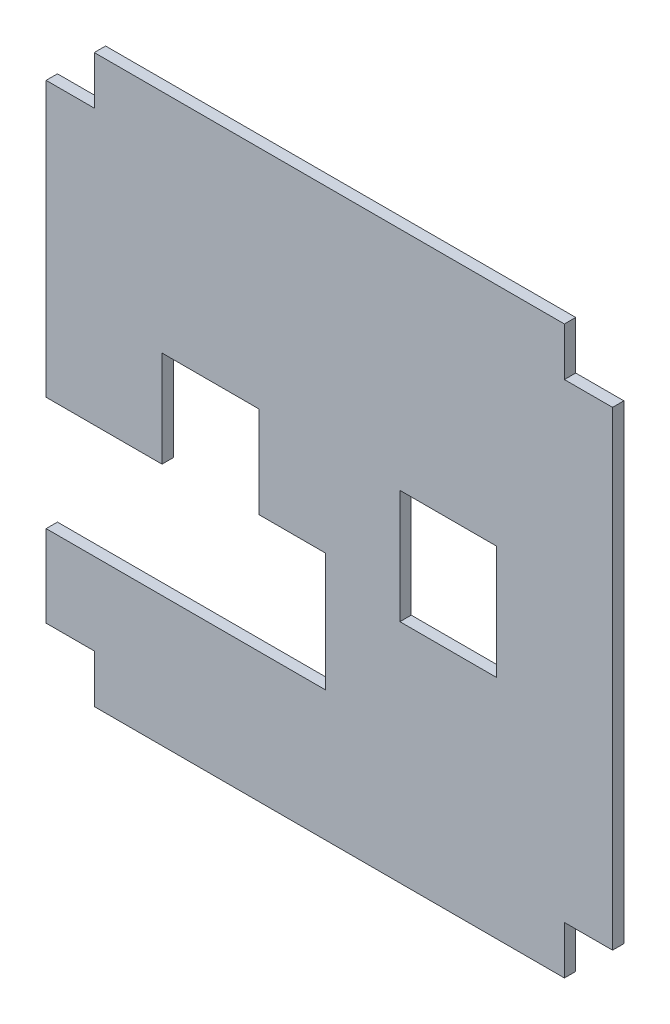
ISO-10303-21;
HEADER;
FILE_DESCRIPTION(('STEP AP214'),'2;1');
FILE_NAME('part.step','',(''),(''),'','','');
FILE_SCHEMA(('AUTOMOTIVE_DESIGN { 1 0 10303 214 1 1 1 1 }'));
ENDSEC;
DATA;
#1=APPLICATION_CONTEXT('core data for automotive mechanical design processes');
#2=APPLICATION_PROTOCOL_DEFINITION('international standard','automotive_design',2000,#1);
#3=PRODUCT_CONTEXT('',#1,'mechanical');
#4=PRODUCT('Part','Part','',(#3));
#5=PRODUCT_RELATED_PRODUCT_CATEGORY('part','',(#4));
#6=PRODUCT_DEFINITION_FORMATION('','',#4);
#7=PRODUCT_DEFINITION_CONTEXT('part definition',#1,'design');
#8=PRODUCT_DEFINITION('design','',#6,#7);
#9=PRODUCT_DEFINITION_SHAPE('','',#8);
#10=(LENGTH_UNIT() NAMED_UNIT(*) SI_UNIT(.MILLI.,.METRE.));
#11=(NAMED_UNIT(*) PLANE_ANGLE_UNIT() SI_UNIT($,.RADIAN.));
#12=(NAMED_UNIT(*) SI_UNIT($,.STERADIAN.) SOLID_ANGLE_UNIT());
#13=UNCERTAINTY_MEASURE_WITH_UNIT(LENGTH_MEASURE(1.E-05),#10,'distance_accuracy_value','');
#14=(GEOMETRIC_REPRESENTATION_CONTEXT(3) GLOBAL_UNCERTAINTY_ASSIGNED_CONTEXT((#13)) GLOBAL_UNIT_ASSIGNED_CONTEXT((#10,
#11,#12)) REPRESENTATION_CONTEXT('',''));
#15=CARTESIAN_POINT('',(0.,0.,0.));
#16=DIRECTION('',(0.,0.,1.));
#17=DIRECTION('',(1.,0.,0.));
#18=AXIS2_PLACEMENT_3D('',#15,#16,#17);
#19=CARTESIAN_POINT('',(0.,0.,2.));
#20=DIRECTION('',(0.,0.,1.));
#21=DIRECTION('',(1.,0.,0.));
#22=AXIS2_PLACEMENT_3D('',#19,#20,#21);
#23=PLANE('',#22);
#24=DIRECTION('',(0.,1.,0.));
#25=VECTOR('',#24,1.);
#26=CARTESIAN_POINT('',(-66.7256915186091,-230.23629040322,2.));
#27=LINE('',#26,#25);
#28=CARTESIAN_POINT('',(-66.7256915186091,-230.23629040322,2.));
#29=VERTEX_POINT('',#28);
#30=CARTESIAN_POINT('',(-66.7256915186091,-221.73629040322,2.));
#31=VERTEX_POINT('',#30);
#32=EDGE_CURVE('E232',#29,#31,#27,.T.);
#33=ORIENTED_EDGE('',*,*,#32,.T.);
#34=DIRECTION('',(-1.,0.,0.));
#35=VECTOR('',#34,1.);
#36=CARTESIAN_POINT('',(-66.7256915186091,-221.73629040322,2.));
#37=LINE('',#36,#35);
#38=CARTESIAN_POINT('',(-149.725691518609,-221.73629040322,2.));
#39=VERTEX_POINT('',#38);
#40=EDGE_CURVE('E235',#31,#39,#37,.T.);
#41=ORIENTED_EDGE('',*,*,#40,.T.);
#42=DIRECTION('',(0.,-1.,0.));
#43=VECTOR('',#42,1.);
#44=CARTESIAN_POINT('',(-149.725691518609,-221.73629040322,2.));
#45=LINE('',#44,#43);
#46=CARTESIAN_POINT('',(-149.725691518609,-230.23629040322,2.));
#47=VERTEX_POINT('',#46);
#48=EDGE_CURVE('E238',#39,#47,#45,.T.);
#49=ORIENTED_EDGE('',*,*,#48,.T.);
#50=DIRECTION('',(-1.,0.,0.));
#51=VECTOR('',#50,1.);
#52=CARTESIAN_POINT('',(-149.725691518609,-230.23629040322,2.));
#53=LINE('',#52,#51);
#54=CARTESIAN_POINT('',(-158.225691518609,-230.23629040322,2.));
#55=VERTEX_POINT('',#54);
#56=EDGE_CURVE('E240',#47,#55,#53,.T.);
#57=ORIENTED_EDGE('',*,*,#56,.T.);
#58=DIRECTION('',(0.,-1.,0.));
#59=VECTOR('',#58,1.);
#60=CARTESIAN_POINT('',(-158.225691518609,-230.23629040322,2.));
#61=LINE('',#60,#59);
#62=CARTESIAN_POINT('',(-158.225691518609,-278.696286353221,2.));
#63=VERTEX_POINT('',#62);
#64=EDGE_CURVE('E242',#55,#63,#61,.T.);
#65=ORIENTED_EDGE('',*,*,#64,.T.);
#66=DIRECTION('',(1.,0.,0.));
#67=VECTOR('',#66,1.);
#68=CARTESIAN_POINT('',(-158.225691518609,-278.696286353221,2.));
#69=LINE('',#68,#67);
#70=CARTESIAN_POINT('',(-137.765694758609,-278.696286353221,2.));
#71=VERTEX_POINT('',#70);
#72=EDGE_CURVE('E244',#63,#71,#69,.T.);
#73=ORIENTED_EDGE('',*,*,#72,.T.);
#74=DIRECTION('',(0.,1.,0.));
#75=VECTOR('',#74,1.);
#76=CARTESIAN_POINT('',(-137.765694758609,-261.696286353221,2.));
#77=LINE('',#76,#75);
#78=CARTESIAN_POINT('',(-137.765694758609,-261.696286353221,2.));
#79=VERTEX_POINT('',#78);
#80=EDGE_CURVE('E246',#71,#79,#77,.T.);
#81=ORIENTED_EDGE('',*,*,#80,.T.);
#82=DIRECTION('',(1.,0.,0.));
#83=VECTOR('',#82,1.);
#84=CARTESIAN_POINT('',(-120.685688280496,-261.696286353221,2.));
#85=LINE('',#84,#83);
#86=CARTESIAN_POINT('',(-120.685688280496,-261.696286353221,2.));
#87=VERTEX_POINT('',#86);
#88=EDGE_CURVE('E248',#79,#87,#85,.T.);
#89=ORIENTED_EDGE('',*,*,#88,.T.);
#90=DIRECTION('',(0.,-1.,0.));
#91=VECTOR('',#90,1.);
#92=CARTESIAN_POINT('',(-120.685688280496,-277.856055269979,2.));
#93=LINE('',#92,#91);
#94=CARTESIAN_POINT('',(-120.685688280496,-277.856055269979,2.));
#95=VERTEX_POINT('',#94);
#96=EDGE_CURVE('E250',#87,#95,#93,.T.);
#97=ORIENTED_EDGE('',*,*,#96,.T.);
#98=DIRECTION('',(1.,0.,0.));
#99=VECTOR('',#98,1.);
#100=CARTESIAN_POINT('',(-120.685688280496,-277.856055269979,2.));
#101=LINE('',#100,#99);
#102=CARTESIAN_POINT('',(-108.863916488469,-277.856055269979,2.));
#103=VERTEX_POINT('',#102);
#104=EDGE_CURVE('E252',#95,#103,#101,.T.);
#105=ORIENTED_EDGE('',*,*,#104,.T.);
#106=DIRECTION('',(0.,-1.,0.));
#107=VECTOR('',#106,1.);
#108=CARTESIAN_POINT('',(-108.863916488469,-277.856055269979,2.));
#109=LINE('',#108,#107);
#110=CARTESIAN_POINT('',(-108.863916488469,-298.77629445322,2.));
#111=VERTEX_POINT('',#110);
#112=EDGE_CURVE('E254',#103,#111,#109,.T.);
#113=ORIENTED_EDGE('',*,*,#112,.T.);
#114=DIRECTION('',(-1.,0.,0.));
#115=VECTOR('',#114,1.);
#116=CARTESIAN_POINT('',(-122.185689088609,-298.77629445322,2.));
#117=LINE('',#116,#115);
#118=CARTESIAN_POINT('',(-158.225691518609,-298.77629445322,2.));
#119=VERTEX_POINT('',#118);
#120=EDGE_CURVE('E256',#111,#119,#117,.T.);
#121=ORIENTED_EDGE('',*,*,#120,.T.);
#122=DIRECTION('',(0.,-1.,0.));
#123=VECTOR('',#122,1.);
#124=CARTESIAN_POINT('',(-158.225691518609,-298.77629445322,2.));
#125=LINE('',#124,#123);
#126=CARTESIAN_POINT('',(-158.225691518609,-313.23629040322,2.));
#127=VERTEX_POINT('',#126);
#128=EDGE_CURVE('E258',#119,#127,#125,.T.);
#129=ORIENTED_EDGE('',*,*,#128,.T.);
#130=DIRECTION('',(1.,0.,0.));
#131=VECTOR('',#130,1.);
#132=CARTESIAN_POINT('',(-158.225691518609,-313.23629040322,2.));
#133=LINE('',#132,#131);
#134=CARTESIAN_POINT('',(-149.725691518609,-313.23629040322,2.));
#135=VERTEX_POINT('',#134);
#136=EDGE_CURVE('E260',#127,#135,#133,.T.);
#137=ORIENTED_EDGE('',*,*,#136,.T.);
#138=DIRECTION('',(0.,-1.,0.));
#139=VECTOR('',#138,1.);
#140=CARTESIAN_POINT('',(-149.725691518609,-313.23629040322,2.));
#141=LINE('',#140,#139);
#142=CARTESIAN_POINT('',(-149.725691518609,-321.73629040322,2.));
#143=VERTEX_POINT('',#142);
#144=EDGE_CURVE('E262',#135,#143,#141,.T.);
#145=ORIENTED_EDGE('',*,*,#144,.T.);
#146=DIRECTION('',(1.,0.,0.));
#147=VECTOR('',#146,1.);
#148=CARTESIAN_POINT('',(-149.725691518609,-321.73629040322,2.));
#149=LINE('',#148,#147);
#150=CARTESIAN_POINT('',(-66.7256915186091,-321.73629040322,2.));
#151=VERTEX_POINT('',#150);
#152=EDGE_CURVE('E264',#143,#151,#149,.T.);
#153=ORIENTED_EDGE('',*,*,#152,.T.);
#154=DIRECTION('',(0.,1.,0.));
#155=VECTOR('',#154,1.);
#156=CARTESIAN_POINT('',(-66.7256915186091,-321.73629040322,2.));
#157=LINE('',#156,#155);
#158=CARTESIAN_POINT('',(-66.7256915186091,-313.23629040322,2.));
#159=VERTEX_POINT('',#158);
#160=EDGE_CURVE('E266',#151,#159,#157,.T.);
#161=ORIENTED_EDGE('',*,*,#160,.T.);
#162=DIRECTION('',(1.,0.,0.));
#163=VECTOR('',#162,1.);
#164=CARTESIAN_POINT('',(-66.7256915186091,-313.23629040322,2.));
#165=LINE('',#164,#163);
#166=CARTESIAN_POINT('',(-58.2256915186091,-313.23629040322,2.));
#167=VERTEX_POINT('',#166);
#168=EDGE_CURVE('E268',#159,#167,#165,.T.);
#169=ORIENTED_EDGE('',*,*,#168,.T.);
#170=DIRECTION('',(0.,1.,0.));
#171=VECTOR('',#170,1.);
#172=CARTESIAN_POINT('',(-58.2256915186091,-313.23629040322,2.));
#173=LINE('',#172,#171);
#174=CARTESIAN_POINT('',(-58.2256915186091,-230.23629040322,2.));
#175=VERTEX_POINT('',#174);
#176=EDGE_CURVE('E270',#167,#175,#173,.T.);
#177=ORIENTED_EDGE('',*,*,#176,.T.);
#178=DIRECTION('',(-1.,0.,0.));
#179=VECTOR('',#178,1.);
#180=CARTESIAN_POINT('',(-58.2256915186091,-230.23629040322,2.));
#181=LINE('',#180,#179);
#182=EDGE_CURVE('E272',#175,#29,#181,.T.);
#183=ORIENTED_EDGE('',*,*,#182,.T.);
#184=EDGE_LOOP('',(#33,#41,#49,#57,#65,#73,#81,#89,#97,#105,#113,#121,#129,#137,#145,#153,#161,
#169,#177,#183));
#185=FACE_BOUND('',#184,.T.);
#186=DIRECTION('',(0.,-1.,0.));
#187=VECTOR('',#186,1.);
#188=CARTESIAN_POINT('',(-95.7656947578864,-261.696286353221,2.));
#189=LINE('',#188,#187);
#190=CARTESIAN_POINT('',(-95.7656947578864,-261.696286353221,2.));
#191=VERTEX_POINT('',#190);
#192=CARTESIAN_POINT('',(-95.7656947578864,-281.77629445322,2.));
#193=VERTEX_POINT('',#192);
#194=EDGE_CURVE('E204',#191,#193,#189,.T.);
#195=ORIENTED_EDGE('',*,*,#194,.F.);
#196=DIRECTION('',(-1.,0.,0.));
#197=VECTOR('',#196,1.);
#198=CARTESIAN_POINT('',(-78.685688278609,-261.696286353221,2.));
#199=LINE('',#198,#197);
#200=CARTESIAN_POINT('',(-78.685688278609,-261.696286353221,2.));
#201=VERTEX_POINT('',#200);
#202=EDGE_CURVE('E196',#201,#191,#199,.T.);
#203=ORIENTED_EDGE('',*,*,#202,.F.);
#204=DIRECTION('',(0.,1.,0.));
#205=VECTOR('',#204,1.);
#206=CARTESIAN_POINT('',(-78.685688278609,-281.77629445322,2.));
#207=LINE('',#206,#205);
#208=CARTESIAN_POINT('',(-78.685688278609,-281.77629445322,2.));
#209=VERTEX_POINT('',#208);
#210=EDGE_CURVE('E218',#209,#201,#207,.T.);
#211=ORIENTED_EDGE('',*,*,#210,.F.);
#212=DIRECTION('',(1.,0.,0.));
#213=VECTOR('',#212,1.);
#214=CARTESIAN_POINT('',(-95.7656947578864,-281.77629445322,2.));
#215=LINE('',#214,#213);
#216=EDGE_CURVE('E216',#193,#209,#215,.T.);
#217=ORIENTED_EDGE('',*,*,#216,.F.);
#218=EDGE_LOOP('',(#195,#203,#211,#217));
#219=FACE_BOUND('',#218,.T.);
#220=ADVANCED_FACE('F35',(#185,#219),#23,.T.);
#221=CARTESIAN_POINT('',(0.,0.,0.));
#222=DIRECTION('',(0.,0.,1.));
#223=DIRECTION('',(1.,0.,0.));
#224=AXIS2_PLACEMENT_3D('',#221,#222,#223);
#225=PLANE('',#224);
#226=DIRECTION('',(0.,1.,0.));
#227=VECTOR('',#226,1.);
#228=CARTESIAN_POINT('',(-66.7256915186091,-230.23629040322,0.));
#229=LINE('',#228,#227);
#230=CARTESIAN_POINT('',(-66.7256915186091,-230.23629040322,0.));
#231=VERTEX_POINT('',#230);
#232=CARTESIAN_POINT('',(-66.7256915186091,-221.73629040322,0.));
#233=VERTEX_POINT('',#232);
#234=EDGE_CURVE('E212',#231,#233,#229,.T.);
#235=ORIENTED_EDGE('',*,*,#234,.F.);
#236=DIRECTION('',(-1.,0.,0.));
#237=VECTOR('',#236,1.);
#238=CARTESIAN_POINT('',(-58.2256915186091,-230.23629040322,0.));
#239=LINE('',#238,#237);
#240=CARTESIAN_POINT('',(-58.2256915186091,-230.23629040322,0.));
#241=VERTEX_POINT('',#240);
#242=EDGE_CURVE('E236',#241,#231,#239,.T.);
#243=ORIENTED_EDGE('',*,*,#242,.F.);
#244=DIRECTION('',(0.,1.,0.));
#245=VECTOR('',#244,1.);
#246=CARTESIAN_POINT('',(-58.2256915186091,-313.23629040322,0.));
#247=LINE('',#246,#245);
#248=CARTESIAN_POINT('',(-58.2256915186091,-313.23629040322,0.));
#249=VERTEX_POINT('',#248);
#250=EDGE_CURVE('E313',#249,#241,#247,.T.);
#251=ORIENTED_EDGE('',*,*,#250,.F.);
#252=DIRECTION('',(1.,0.,0.));
#253=VECTOR('',#252,1.);
#254=CARTESIAN_POINT('',(-66.7256915186091,-313.23629040322,0.));
#255=LINE('',#254,#253);
#256=CARTESIAN_POINT('',(-66.7256915186091,-313.23629040322,0.));
#257=VERTEX_POINT('',#256);
#258=EDGE_CURVE('E311',#257,#249,#255,.T.);
#259=ORIENTED_EDGE('',*,*,#258,.F.);
#260=DIRECTION('',(0.,1.,0.));
#261=VECTOR('',#260,1.);
#262=CARTESIAN_POINT('',(-66.7256915186091,-321.73629040322,0.));
#263=LINE('',#262,#261);
#264=CARTESIAN_POINT('',(-66.7256915186091,-321.73629040322,0.));
#265=VERTEX_POINT('',#264);
#266=EDGE_CURVE('E309',#265,#257,#263,.T.);
#267=ORIENTED_EDGE('',*,*,#266,.F.);
#268=DIRECTION('',(1.,0.,0.));
#269=VECTOR('',#268,1.);
#270=CARTESIAN_POINT('',(-149.725691518609,-321.73629040322,0.));
#271=LINE('',#270,#269);
#272=CARTESIAN_POINT('',(-149.725691518609,-321.73629040322,0.));
#273=VERTEX_POINT('',#272);
#274=EDGE_CURVE('E307',#273,#265,#271,.T.);
#275=ORIENTED_EDGE('',*,*,#274,.F.);
#276=DIRECTION('',(0.,-1.,0.));
#277=VECTOR('',#276,1.);
#278=CARTESIAN_POINT('',(-149.725691518609,-313.23629040322,0.));
#279=LINE('',#278,#277);
#280=CARTESIAN_POINT('',(-149.725691518609,-313.23629040322,0.));
#281=VERTEX_POINT('',#280);
#282=EDGE_CURVE('E305',#281,#273,#279,.T.);
#283=ORIENTED_EDGE('',*,*,#282,.F.);
#284=DIRECTION('',(1.,0.,0.));
#285=VECTOR('',#284,1.);
#286=CARTESIAN_POINT('',(-158.225691518609,-313.23629040322,0.));
#287=LINE('',#286,#285);
#288=CARTESIAN_POINT('',(-158.225691518609,-313.23629040322,0.));
#289=VERTEX_POINT('',#288);
#290=EDGE_CURVE('E303',#289,#281,#287,.T.);
#291=ORIENTED_EDGE('',*,*,#290,.F.);
#292=DIRECTION('',(0.,-1.,0.));
#293=VECTOR('',#292,1.);
#294=CARTESIAN_POINT('',(-158.225691518609,-298.77629445322,0.));
#295=LINE('',#294,#293);
#296=CARTESIAN_POINT('',(-158.225691518609,-298.77629445322,0.));
#297=VERTEX_POINT('',#296);
#298=EDGE_CURVE('E301',#297,#289,#295,.T.);
#299=ORIENTED_EDGE('',*,*,#298,.F.);
#300=DIRECTION('',(-1.,0.,0.));
#301=VECTOR('',#300,1.);
#302=CARTESIAN_POINT('',(-122.185689088609,-298.77629445322,0.));
#303=LINE('',#302,#301);
#304=CARTESIAN_POINT('',(-108.863916488469,-298.77629445322,0.));
#305=VERTEX_POINT('',#304);
#306=EDGE_CURVE('E299',#305,#297,#303,.T.);
#307=ORIENTED_EDGE('',*,*,#306,.F.);
#308=DIRECTION('',(0.,-1.,0.));
#309=VECTOR('',#308,1.);
#310=CARTESIAN_POINT('',(-108.863916488469,-298.77629445322,0.));
#311=LINE('',#310,#309);
#312=CARTESIAN_POINT('',(-108.863916488469,-277.856055269979,0.));
#313=VERTEX_POINT('',#312);
#314=EDGE_CURVE('E296',#313,#305,#311,.T.);
#315=ORIENTED_EDGE('',*,*,#314,.F.);
#316=DIRECTION('',(1.,0.,0.));
#317=VECTOR('',#316,1.);
#318=CARTESIAN_POINT('',(-120.685688280496,-277.856055269979,0.));
#319=LINE('',#318,#317);
#320=CARTESIAN_POINT('',(-120.685688280496,-277.856055269979,0.));
#321=VERTEX_POINT('',#320);
#322=EDGE_CURVE('E293',#321,#313,#319,.T.);
#323=ORIENTED_EDGE('',*,*,#322,.F.);
#324=DIRECTION('',(0.,-1.,0.));
#325=VECTOR('',#324,1.);
#326=CARTESIAN_POINT('',(-120.685688280496,-277.856055269979,0.));
#327=LINE('',#326,#325);
#328=CARTESIAN_POINT('',(-120.685688280496,-261.696286353221,0.));
#329=VERTEX_POINT('',#328);
#330=EDGE_CURVE('E291',#329,#321,#327,.T.);
#331=ORIENTED_EDGE('',*,*,#330,.F.);
#332=DIRECTION('',(1.,0.,0.));
#333=VECTOR('',#332,1.);
#334=CARTESIAN_POINT('',(-120.685688280496,-261.696286353221,0.));
#335=LINE('',#334,#333);
#336=CARTESIAN_POINT('',(-137.765694758609,-261.696286353221,0.));
#337=VERTEX_POINT('',#336);
#338=EDGE_CURVE('E289',#337,#329,#335,.T.);
#339=ORIENTED_EDGE('',*,*,#338,.F.);
#340=DIRECTION('',(0.,1.,0.));
#341=VECTOR('',#340,1.);
#342=CARTESIAN_POINT('',(-137.765694758609,-261.696286353221,0.));
#343=LINE('',#342,#341);
#344=CARTESIAN_POINT('',(-137.765694758609,-278.696286353221,0.));
#345=VERTEX_POINT('',#344);
#346=EDGE_CURVE('E287',#345,#337,#343,.T.);
#347=ORIENTED_EDGE('',*,*,#346,.F.);
#348=DIRECTION('',(1.,0.,0.));
#349=VECTOR('',#348,1.);
#350=CARTESIAN_POINT('',(-158.225691518609,-278.696286353221,0.));
#351=LINE('',#350,#349);
#352=CARTESIAN_POINT('',(-158.225691518609,-278.696286353221,0.));
#353=VERTEX_POINT('',#352);
#354=EDGE_CURVE('E285',#353,#345,#351,.T.);
#355=ORIENTED_EDGE('',*,*,#354,.F.);
#356=DIRECTION('',(0.,-1.,0.));
#357=VECTOR('',#356,1.);
#358=CARTESIAN_POINT('',(-158.225691518609,-230.23629040322,0.));
#359=LINE('',#358,#357);
#360=CARTESIAN_POINT('',(-158.225691518609,-230.23629040322,0.));
#361=VERTEX_POINT('',#360);
#362=EDGE_CURVE('E283',#361,#353,#359,.T.);
#363=ORIENTED_EDGE('',*,*,#362,.F.);
#364=DIRECTION('',(-1.,0.,0.));
#365=VECTOR('',#364,1.);
#366=CARTESIAN_POINT('',(-149.725691518609,-230.23629040322,0.));
#367=LINE('',#366,#365);
#368=CARTESIAN_POINT('',(-149.725691518609,-230.23629040322,0.));
#369=VERTEX_POINT('',#368);
#370=EDGE_CURVE('E281',#369,#361,#367,.T.);
#371=ORIENTED_EDGE('',*,*,#370,.F.);
#372=DIRECTION('',(0.,-1.,0.));
#373=VECTOR('',#372,1.);
#374=CARTESIAN_POINT('',(-149.725691518609,-221.73629040322,0.));
#375=LINE('',#374,#373);
#376=CARTESIAN_POINT('',(-149.725691518609,-221.73629040322,0.));
#377=VERTEX_POINT('',#376);
#378=EDGE_CURVE('E279',#377,#369,#375,.T.);
#379=ORIENTED_EDGE('',*,*,#378,.F.);
#380=DIRECTION('',(-1.,0.,0.));
#381=VECTOR('',#380,1.);
#382=CARTESIAN_POINT('',(-66.7256915186091,-221.73629040322,0.));
#383=LINE('',#382,#381);
#384=EDGE_CURVE('E277',#233,#377,#383,.T.);
#385=ORIENTED_EDGE('',*,*,#384,.F.);
#386=EDGE_LOOP('',(#235,#243,#251,#259,#267,#275,#283,#291,#299,#307,#315,#323,#331,#339,#347,
#355,#363,#371,#379,#385));
#387=FACE_BOUND('',#386,.T.);
#388=DIRECTION('',(-1.,0.,0.));
#389=VECTOR('',#388,1.);
#390=CARTESIAN_POINT('',(-78.685688278609,-261.696286353221,0.));
#391=LINE('',#390,#389);
#392=CARTESIAN_POINT('',(-78.685688278609,-261.696286353221,0.));
#393=VERTEX_POINT('',#392);
#394=CARTESIAN_POINT('',(-95.7656947578864,-261.696286353221,0.));
#395=VERTEX_POINT('',#394);
#396=EDGE_CURVE('E58',#393,#395,#391,.T.);
#397=ORIENTED_EDGE('',*,*,#396,.T.);
#398=DIRECTION('',(0.,-1.,0.));
#399=VECTOR('',#398,1.);
#400=CARTESIAN_POINT('',(-95.7656947578864,-261.696286353221,0.));
#401=LINE('',#400,#399);
#402=CARTESIAN_POINT('',(-95.7656947578864,-281.77629445322,0.));
#403=VERTEX_POINT('',#402);
#404=EDGE_CURVE('E211',#395,#403,#401,.T.);
#405=ORIENTED_EDGE('',*,*,#404,.T.);
#406=DIRECTION('',(1.,0.,0.));
#407=VECTOR('',#406,1.);
#408=CARTESIAN_POINT('',(-95.7656947578864,-281.77629445322,0.));
#409=LINE('',#408,#407);
#410=CARTESIAN_POINT('',(-78.685688278609,-281.77629445322,0.));
#411=VERTEX_POINT('',#410);
#412=EDGE_CURVE('E224',#403,#411,#409,.T.);
#413=ORIENTED_EDGE('',*,*,#412,.T.);
#414=DIRECTION('',(0.,1.,0.));
#415=VECTOR('',#414,1.);
#416=CARTESIAN_POINT('',(-78.685688278609,-281.77629445322,0.));
#417=LINE('',#416,#415);
#418=EDGE_CURVE('E205',#411,#393,#417,.T.);
#419=ORIENTED_EDGE('',*,*,#418,.T.);
#420=EDGE_LOOP('',(#397,#405,#413,#419));
#421=FACE_BOUND('',#420,.T.);
#422=ADVANCED_FACE('F379',(#387,#421),#225,.F.);
#423=CARTESIAN_POINT('',(-66.7256915186091,-230.23629040322,2.));
#424=DIRECTION('',(-1.,0.,0.));
#425=DIRECTION('',(0.,-1.,0.));
#426=AXIS2_PLACEMENT_3D('',#423,#424,#425);
#427=PLANE('',#426);
#428=ORIENTED_EDGE('',*,*,#234,.T.);
#429=DIRECTION('',(0.,0.,-1.));
#430=VECTOR('',#429,1.);
#431=CARTESIAN_POINT('',(-66.7256915186091,-221.73629040322,2.));
#432=LINE('',#431,#430);
#433=EDGE_CURVE('E11',#31,#233,#432,.T.);
#434=ORIENTED_EDGE('',*,*,#433,.F.);
#435=ORIENTED_EDGE('',*,*,#32,.F.);
#436=DIRECTION('',(0.,0.,-1.));
#437=VECTOR('',#436,1.);
#438=CARTESIAN_POINT('',(-66.7256915186091,-230.23629040322,2.));
#439=LINE('',#438,#437);
#440=EDGE_CURVE('E274',#29,#231,#439,.T.);
#441=ORIENTED_EDGE('',*,*,#440,.T.);
#442=EDGE_LOOP('',(#428,#434,#435,#441));
#443=FACE_BOUND('',#442,.T.);
#444=ADVANCED_FACE('F37',(#443),#427,.F.);
#445=CARTESIAN_POINT('',(-66.7256915186091,-221.73629040322,2.));
#446=DIRECTION('',(0.,-1.,0.));
#447=DIRECTION('',(0.,0.,-1.));
#448=AXIS2_PLACEMENT_3D('',#445,#446,#447);
#449=PLANE('',#448);
#450=ORIENTED_EDGE('',*,*,#384,.T.);
#451=DIRECTION('',(0.,0.,-1.));
#452=VECTOR('',#451,1.);
#453=CARTESIAN_POINT('',(-149.725691518609,-221.73629040322,2.));
#454=LINE('',#453,#452);
#455=EDGE_CURVE('E43',#39,#377,#454,.T.);
#456=ORIENTED_EDGE('',*,*,#455,.F.);
#457=ORIENTED_EDGE('',*,*,#40,.F.);
#458=ORIENTED_EDGE('',*,*,#433,.T.);
#459=EDGE_LOOP('',(#450,#456,#457,#458));
#460=FACE_BOUND('',#459,.T.);
#461=ADVANCED_FACE('F396',(#460),#449,.F.);
#462=CARTESIAN_POINT('',(-149.725691518609,-221.73629040322,2.));
#463=DIRECTION('',(1.,0.,0.));
#464=DIRECTION('',(0.,0.,-1.));
#465=AXIS2_PLACEMENT_3D('',#462,#463,#464);
#466=PLANE('',#465);
#467=ORIENTED_EDGE('',*,*,#378,.T.);
#468=DIRECTION('',(0.,0.,-1.));
#469=VECTOR('',#468,1.);
#470=CARTESIAN_POINT('',(-149.725691518609,-230.23629040322,2.));
#471=LINE('',#470,#469);
#472=EDGE_CURVE('E366',#47,#369,#471,.T.);
#473=ORIENTED_EDGE('',*,*,#472,.F.);
#474=ORIENTED_EDGE('',*,*,#48,.F.);
#475=ORIENTED_EDGE('',*,*,#455,.T.);
#476=EDGE_LOOP('',(#467,#473,#474,#475));
#477=FACE_BOUND('',#476,.T.);
#478=ADVANCED_FACE('F373',(#477),#466,.F.);
#479=CARTESIAN_POINT('',(-149.725691518609,-230.23629040322,2.));
#480=DIRECTION('',(0.,-1.,0.));
#481=DIRECTION('',(0.,0.,-1.));
#482=AXIS2_PLACEMENT_3D('',#479,#480,#481);
#483=PLANE('',#482);
#484=ORIENTED_EDGE('',*,*,#370,.T.);
#485=DIRECTION('',(0.,0.,-1.));
#486=VECTOR('',#485,1.);
#487=CARTESIAN_POINT('',(-158.225691518609,-230.23629040322,2.));
#488=LINE('',#487,#486);
#489=EDGE_CURVE('E363',#55,#361,#488,.T.);
#490=ORIENTED_EDGE('',*,*,#489,.F.);
#491=ORIENTED_EDGE('',*,*,#56,.F.);
#492=ORIENTED_EDGE('',*,*,#472,.T.);
#493=EDGE_LOOP('',(#484,#490,#491,#492));
#494=FACE_BOUND('',#493,.T.);
#495=ADVANCED_FACE('F385',(#494),#483,.F.);
#496=CARTESIAN_POINT('',(-158.225691518609,-230.23629040322,2.));
#497=DIRECTION('',(1.,0.,0.));
#498=DIRECTION('',(0.,0.,-1.));
#499=AXIS2_PLACEMENT_3D('',#496,#497,#498);
#500=PLANE('',#499);
#501=ORIENTED_EDGE('',*,*,#362,.T.);
#502=DIRECTION('',(0.,0.,-1.));
#503=VECTOR('',#502,1.);
#504=CARTESIAN_POINT('',(-158.225691518609,-278.696286353221,2.));
#505=LINE('',#504,#503);
#506=EDGE_CURVE('E360',#63,#353,#505,.T.);
#507=ORIENTED_EDGE('',*,*,#506,.F.);
#508=ORIENTED_EDGE('',*,*,#64,.F.);
#509=ORIENTED_EDGE('',*,*,#489,.T.);
#510=EDGE_LOOP('',(#501,#507,#508,#509));
#511=FACE_BOUND('',#510,.T.);
#512=ADVANCED_FACE('F389',(#511),#500,.F.);
#513=CARTESIAN_POINT('',(-158.225691518609,-278.696286353221,2.));
#514=DIRECTION('',(0.,1.,0.));
#515=DIRECTION('',(0.,0.,1.));
#516=AXIS2_PLACEMENT_3D('',#513,#514,#515);
#517=PLANE('',#516);
#518=ORIENTED_EDGE('',*,*,#354,.T.);
#519=DIRECTION('',(0.,0.,-1.));
#520=VECTOR('',#519,1.);
#521=CARTESIAN_POINT('',(-137.765694758609,-278.696286353221,2.));
#522=LINE('',#521,#520);
#523=EDGE_CURVE('E357',#71,#345,#522,.T.);
#524=ORIENTED_EDGE('',*,*,#523,.F.);
#525=ORIENTED_EDGE('',*,*,#72,.F.);
#526=ORIENTED_EDGE('',*,*,#506,.T.);
#527=EDGE_LOOP('',(#518,#524,#525,#526));
#528=FACE_BOUND('',#527,.T.);
#529=ADVANCED_FACE('F467',(#528),#517,.F.);
#530=CARTESIAN_POINT('',(-137.765694758609,-261.696286353221,2.));
#531=DIRECTION('',(-1.,0.,0.));
#532=DIRECTION('',(0.,0.,1.));
#533=AXIS2_PLACEMENT_3D('',#530,#531,#532);
#534=PLANE('',#533);
#535=ORIENTED_EDGE('',*,*,#346,.T.);
#536=DIRECTION('',(0.,0.,-1.));
#537=VECTOR('',#536,1.);
#538=CARTESIAN_POINT('',(-137.765694758609,-261.696286353221,2.));
#539=LINE('',#538,#537);
#540=EDGE_CURVE('E354',#79,#337,#539,.T.);
#541=ORIENTED_EDGE('',*,*,#540,.F.);
#542=ORIENTED_EDGE('',*,*,#80,.F.);
#543=ORIENTED_EDGE('',*,*,#523,.T.);
#544=EDGE_LOOP('',(#535,#541,#542,#543));
#545=FACE_BOUND('',#544,.T.);
#546=ADVANCED_FACE('F465',(#545),#534,.F.);
#547=CARTESIAN_POINT('',(-120.685688280496,-261.696286353221,2.));
#548=DIRECTION('',(0.,1.,0.));
#549=DIRECTION('',(0.,0.,1.));
#550=AXIS2_PLACEMENT_3D('',#547,#548,#549);
#551=PLANE('',#550);
#552=ORIENTED_EDGE('',*,*,#338,.T.);
#553=DIRECTION('',(0.,0.,-1.));
#554=VECTOR('',#553,1.);
#555=CARTESIAN_POINT('',(-120.685688280496,-261.696286353221,2.));
#556=LINE('',#555,#554);
#557=EDGE_CURVE('E351',#87,#329,#556,.T.);
#558=ORIENTED_EDGE('',*,*,#557,.F.);
#559=ORIENTED_EDGE('',*,*,#88,.F.);
#560=ORIENTED_EDGE('',*,*,#540,.T.);
#561=EDGE_LOOP('',(#552,#558,#559,#560));
#562=FACE_BOUND('',#561,.T.);
#563=ADVANCED_FACE('F461',(#562),#551,.F.);
#564=CARTESIAN_POINT('',(-120.685688280496,-277.856055269979,2.));
#565=DIRECTION('',(1.,0.,0.));
#566=DIRECTION('',(0.,0.,-1.));
#567=AXIS2_PLACEMENT_3D('',#564,#565,#566);
#568=PLANE('',#567);
#569=ORIENTED_EDGE('',*,*,#330,.T.);
#570=DIRECTION('',(0.,0.,-1.));
#571=VECTOR('',#570,1.);
#572=CARTESIAN_POINT('',(-120.685688280496,-277.856055269979,2.));
#573=LINE('',#572,#571);
#574=EDGE_CURVE('E348',#95,#321,#573,.T.);
#575=ORIENTED_EDGE('',*,*,#574,.F.);
#576=ORIENTED_EDGE('',*,*,#96,.F.);
#577=ORIENTED_EDGE('',*,*,#557,.T.);
#578=EDGE_LOOP('',(#569,#575,#576,#577));
#579=FACE_BOUND('',#578,.T.);
#580=ADVANCED_FACE('F456',(#579),#568,.F.);
#581=CARTESIAN_POINT('',(-120.685688280496,-277.856055269979,2.));
#582=DIRECTION('',(0.,1.,0.));
#583=DIRECTION('',(0.,0.,1.));
#584=AXIS2_PLACEMENT_3D('',#581,#582,#583);
#585=PLANE('',#584);
#586=ORIENTED_EDGE('',*,*,#322,.T.);
#587=DIRECTION('',(0.,0.,-1.));
#588=VECTOR('',#587,1.);
#589=CARTESIAN_POINT('',(-108.863916488469,-277.856055269979,2.));
#590=LINE('',#589,#588);
#591=EDGE_CURVE('E345',#103,#313,#590,.T.);
#592=ORIENTED_EDGE('',*,*,#591,.F.);
#593=ORIENTED_EDGE('',*,*,#104,.F.);
#594=ORIENTED_EDGE('',*,*,#574,.T.);
#595=EDGE_LOOP('',(#586,#592,#593,#594));
#596=FACE_BOUND('',#595,.T.);
#597=ADVANCED_FACE('F450',(#596),#585,.F.);
#598=CARTESIAN_POINT('',(-108.863916488469,-298.77629445322,2.));
#599=DIRECTION('',(1.,0.,0.));
#600=DIRECTION('',(0.,0.,-1.));
#601=AXIS2_PLACEMENT_3D('',#598,#599,#600);
#602=PLANE('',#601);
#603=ORIENTED_EDGE('',*,*,#314,.T.);
#604=DIRECTION('',(0.,0.,-1.));
#605=VECTOR('',#604,1.);
#606=CARTESIAN_POINT('',(-108.863916488469,-298.77629445322,2.));
#607=LINE('',#606,#605);
#608=EDGE_CURVE('E342',#111,#305,#607,.T.);
#609=ORIENTED_EDGE('',*,*,#608,.F.);
#610=ORIENTED_EDGE('',*,*,#112,.F.);
#611=ORIENTED_EDGE('',*,*,#591,.T.);
#612=EDGE_LOOP('',(#603,#609,#610,#611));
#613=FACE_BOUND('',#612,.T.);
#614=ADVANCED_FACE('F445',(#613),#602,.F.);
#615=CARTESIAN_POINT('',(-122.185689088609,-298.77629445322,2.));
#616=DIRECTION('',(0.,-1.,0.));
#617=DIRECTION('',(0.,0.,-1.));
#618=AXIS2_PLACEMENT_3D('',#615,#616,#617);
#619=PLANE('',#618);
#620=ORIENTED_EDGE('',*,*,#306,.T.);
#621=DIRECTION('',(0.,0.,-1.));
#622=VECTOR('',#621,1.);
#623=CARTESIAN_POINT('',(-158.225691518609,-298.77629445322,2.));
#624=LINE('',#623,#622);
#625=EDGE_CURVE('E339',#119,#297,#624,.T.);
#626=ORIENTED_EDGE('',*,*,#625,.F.);
#627=ORIENTED_EDGE('',*,*,#120,.F.);
#628=ORIENTED_EDGE('',*,*,#608,.T.);
#629=EDGE_LOOP('',(#620,#626,#627,#628));
#630=FACE_BOUND('',#629,.T.);
#631=ADVANCED_FACE('F441',(#630),#619,.F.);
#632=CARTESIAN_POINT('',(-158.225691518609,-298.77629445322,2.));
#633=DIRECTION('',(1.,0.,0.));
#634=DIRECTION('',(0.,0.,-1.));
#635=AXIS2_PLACEMENT_3D('',#632,#633,#634);
#636=PLANE('',#635);
#637=ORIENTED_EDGE('',*,*,#298,.T.);
#638=DIRECTION('',(0.,0.,-1.));
#639=VECTOR('',#638,1.);
#640=CARTESIAN_POINT('',(-158.225691518609,-313.23629040322,2.));
#641=LINE('',#640,#639);
#642=EDGE_CURVE('E336',#127,#289,#641,.T.);
#643=ORIENTED_EDGE('',*,*,#642,.F.);
#644=ORIENTED_EDGE('',*,*,#128,.F.);
#645=ORIENTED_EDGE('',*,*,#625,.T.);
#646=EDGE_LOOP('',(#637,#643,#644,#645));
#647=FACE_BOUND('',#646,.T.);
#648=ADVANCED_FACE('F437',(#647),#636,.F.);
#649=CARTESIAN_POINT('',(-158.225691518609,-313.23629040322,2.));
#650=DIRECTION('',(0.,1.,0.));
#651=DIRECTION('',(0.,0.,1.));
#652=AXIS2_PLACEMENT_3D('',#649,#650,#651);
#653=PLANE('',#652);
#654=ORIENTED_EDGE('',*,*,#290,.T.);
#655=DIRECTION('',(0.,0.,-1.));
#656=VECTOR('',#655,1.);
#657=CARTESIAN_POINT('',(-149.725691518609,-313.23629040322,2.));
#658=LINE('',#657,#656);
#659=EDGE_CURVE('E333',#135,#281,#658,.T.);
#660=ORIENTED_EDGE('',*,*,#659,.F.);
#661=ORIENTED_EDGE('',*,*,#136,.F.);
#662=ORIENTED_EDGE('',*,*,#642,.T.);
#663=EDGE_LOOP('',(#654,#660,#661,#662));
#664=FACE_BOUND('',#663,.T.);
#665=ADVANCED_FACE('F432',(#664),#653,.F.);
#666=CARTESIAN_POINT('',(-149.725691518609,-313.23629040322,2.));
#667=DIRECTION('',(1.,0.,0.));
#668=DIRECTION('',(0.,0.,-1.));
#669=AXIS2_PLACEMENT_3D('',#666,#667,#668);
#670=PLANE('',#669);
#671=ORIENTED_EDGE('',*,*,#282,.T.);
#672=DIRECTION('',(0.,0.,-1.));
#673=VECTOR('',#672,1.);
#674=CARTESIAN_POINT('',(-149.725691518609,-321.73629040322,2.));
#675=LINE('',#674,#673);
#676=EDGE_CURVE('E330',#143,#273,#675,.T.);
#677=ORIENTED_EDGE('',*,*,#676,.F.);
#678=ORIENTED_EDGE('',*,*,#144,.F.);
#679=ORIENTED_EDGE('',*,*,#659,.T.);
#680=EDGE_LOOP('',(#671,#677,#678,#679));
#681=FACE_BOUND('',#680,.T.);
#682=ADVANCED_FACE('F427',(#681),#670,.F.);
#683=CARTESIAN_POINT('',(-149.725691518609,-321.73629040322,2.));
#684=DIRECTION('',(0.,1.,0.));
#685=DIRECTION('',(0.,0.,1.));
#686=AXIS2_PLACEMENT_3D('',#683,#684,#685);
#687=PLANE('',#686);
#688=ORIENTED_EDGE('',*,*,#274,.T.);
#689=DIRECTION('',(0.,0.,-1.));
#690=VECTOR('',#689,1.);
#691=CARTESIAN_POINT('',(-66.7256915186091,-321.73629040322,2.));
#692=LINE('',#691,#690);
#693=EDGE_CURVE('E327',#151,#265,#692,.T.);
#694=ORIENTED_EDGE('',*,*,#693,.F.);
#695=ORIENTED_EDGE('',*,*,#152,.F.);
#696=ORIENTED_EDGE('',*,*,#676,.T.);
#697=EDGE_LOOP('',(#688,#694,#695,#696));
#698=FACE_BOUND('',#697,.T.);
#699=ADVANCED_FACE('F423',(#698),#687,.F.);
#700=CARTESIAN_POINT('',(-66.7256915186091,-321.73629040322,2.));
#701=DIRECTION('',(-1.,0.,0.));
#702=DIRECTION('',(0.,0.,1.));
#703=AXIS2_PLACEMENT_3D('',#700,#701,#702);
#704=PLANE('',#703);
#705=ORIENTED_EDGE('',*,*,#266,.T.);
#706=DIRECTION('',(0.,0.,-1.));
#707=VECTOR('',#706,1.);
#708=CARTESIAN_POINT('',(-66.7256915186091,-313.23629040322,2.));
#709=LINE('',#708,#707);
#710=EDGE_CURVE('E324',#159,#257,#709,.T.);
#711=ORIENTED_EDGE('',*,*,#710,.F.);
#712=ORIENTED_EDGE('',*,*,#160,.F.);
#713=ORIENTED_EDGE('',*,*,#693,.T.);
#714=EDGE_LOOP('',(#705,#711,#712,#713));
#715=FACE_BOUND('',#714,.T.);
#716=ADVANCED_FACE('F418',(#715),#704,.F.);
#717=CARTESIAN_POINT('',(-66.7256915186091,-313.23629040322,2.));
#718=DIRECTION('',(0.,1.,0.));
#719=DIRECTION('',(0.,0.,1.));
#720=AXIS2_PLACEMENT_3D('',#717,#718,#719);
#721=PLANE('',#720);
#722=ORIENTED_EDGE('',*,*,#258,.T.);
#723=DIRECTION('',(0.,0.,-1.));
#724=VECTOR('',#723,1.);
#725=CARTESIAN_POINT('',(-58.2256915186091,-313.23629040322,2.));
#726=LINE('',#725,#724);
#727=EDGE_CURVE('E321',#167,#249,#726,.T.);
#728=ORIENTED_EDGE('',*,*,#727,.F.);
#729=ORIENTED_EDGE('',*,*,#168,.F.);
#730=ORIENTED_EDGE('',*,*,#710,.T.);
#731=EDGE_LOOP('',(#722,#728,#729,#730));
#732=FACE_BOUND('',#731,.T.);
#733=ADVANCED_FACE('F412',(#732),#721,.F.);
#734=CARTESIAN_POINT('',(-58.2256915186091,-313.23629040322,2.));
#735=DIRECTION('',(-1.,0.,0.));
#736=DIRECTION('',(0.,0.,1.));
#737=AXIS2_PLACEMENT_3D('',#734,#735,#736);
#738=PLANE('',#737);
#739=ORIENTED_EDGE('',*,*,#250,.T.);
#740=DIRECTION('',(0.,0.,-1.));
#741=VECTOR('',#740,1.);
#742=CARTESIAN_POINT('',(-58.2256915186091,-230.23629040322,2.));
#743=LINE('',#742,#741);
#744=EDGE_CURVE('E318',#175,#241,#743,.T.);
#745=ORIENTED_EDGE('',*,*,#744,.F.);
#746=ORIENTED_EDGE('',*,*,#176,.F.);
#747=ORIENTED_EDGE('',*,*,#727,.T.);
#748=EDGE_LOOP('',(#739,#745,#746,#747));
#749=FACE_BOUND('',#748,.T.);
#750=ADVANCED_FACE('F408',(#749),#738,.F.);
#751=CARTESIAN_POINT('',(-58.2256915186091,-230.23629040322,2.));
#752=DIRECTION('',(0.,-1.,0.));
#753=DIRECTION('',(0.,0.,-1.));
#754=AXIS2_PLACEMENT_3D('',#751,#752,#753);
#755=PLANE('',#754);
#756=ORIENTED_EDGE('',*,*,#242,.T.);
#757=ORIENTED_EDGE('',*,*,#440,.F.);
#758=ORIENTED_EDGE('',*,*,#182,.F.);
#759=ORIENTED_EDGE('',*,*,#744,.T.);
#760=EDGE_LOOP('',(#756,#757,#758,#759));
#761=FACE_BOUND('',#760,.T.);
#762=ADVANCED_FACE('F403',(#761),#755,.F.);
#763=CARTESIAN_POINT('',(-78.685688278609,-261.696286353221,2.));
#764=DIRECTION('',(0.,-1.,0.));
#765=DIRECTION('',(0.,0.,-1.));
#766=AXIS2_PLACEMENT_3D('',#763,#764,#765);
#767=PLANE('',#766);
#768=ORIENTED_EDGE('',*,*,#396,.F.);
#769=DIRECTION('',(0.,0.,-1.));
#770=VECTOR('',#769,1.);
#771=CARTESIAN_POINT('',(-78.685688278609,-261.696286353221,2.));
#772=LINE('',#771,#770);
#773=EDGE_CURVE('E200',#201,#393,#772,.T.);
#774=ORIENTED_EDGE('',*,*,#773,.F.);
#775=ORIENTED_EDGE('',*,*,#202,.T.);
#776=DIRECTION('',(0.,0.,-1.));
#777=VECTOR('',#776,1.);
#778=CARTESIAN_POINT('',(-95.7656947578864,-261.696286353221,2.));
#779=LINE('',#778,#777);
#780=EDGE_CURVE('E199',#191,#395,#779,.T.);
#781=ORIENTED_EDGE('',*,*,#780,.T.);
#782=EDGE_LOOP('',(#768,#774,#775,#781));
#783=FACE_BOUND('',#782,.T.);
#784=ADVANCED_FACE('F198',(#783),#767,.T.);
#785=CARTESIAN_POINT('',(-95.7656947578864,-261.696286353221,2.));
#786=DIRECTION('',(1.,0.,0.));
#787=DIRECTION('',(0.,0.,-1.));
#788=AXIS2_PLACEMENT_3D('',#785,#786,#787);
#789=PLANE('',#788);
#790=ORIENTED_EDGE('',*,*,#404,.F.);
#791=ORIENTED_EDGE('',*,*,#780,.F.);
#792=ORIENTED_EDGE('',*,*,#194,.T.);
#793=DIRECTION('',(0.,0.,-1.));
#794=VECTOR('',#793,1.);
#795=CARTESIAN_POINT('',(-95.7656947578864,-281.77629445322,2.));
#796=LINE('',#795,#794);
#797=EDGE_CURVE('E213',#193,#403,#796,.T.);
#798=ORIENTED_EDGE('',*,*,#797,.T.);
#799=EDGE_LOOP('',(#790,#791,#792,#798));
#800=FACE_BOUND('',#799,.T.);
#801=ADVANCED_FACE('F208',(#800),#789,.T.);
#802=CARTESIAN_POINT('',(-95.7656947578864,-281.77629445322,2.));
#803=DIRECTION('',(0.,1.,0.));
#804=DIRECTION('',(0.,0.,1.));
#805=AXIS2_PLACEMENT_3D('',#802,#803,#804);
#806=PLANE('',#805);
#807=ORIENTED_EDGE('',*,*,#412,.F.);
#808=ORIENTED_EDGE('',*,*,#797,.F.);
#809=ORIENTED_EDGE('',*,*,#216,.T.);
#810=DIRECTION('',(0.,0.,-1.));
#811=VECTOR('',#810,1.);
#812=CARTESIAN_POINT('',(-78.685688278609,-281.77629445322,2.));
#813=LINE('',#812,#811);
#814=EDGE_CURVE('E50',#209,#411,#813,.T.);
#815=ORIENTED_EDGE('',*,*,#814,.T.);
#816=EDGE_LOOP('',(#807,#808,#809,#815));
#817=FACE_BOUND('',#816,.T.);
#818=ADVANCED_FACE('F573',(#817),#806,.T.);
#819=CARTESIAN_POINT('',(-78.685688278609,-281.77629445322,2.));
#820=DIRECTION('',(-1.,0.,0.));
#821=DIRECTION('',(0.,0.,1.));
#822=AXIS2_PLACEMENT_3D('',#819,#820,#821);
#823=PLANE('',#822);
#824=ORIENTED_EDGE('',*,*,#418,.F.);
#825=ORIENTED_EDGE('',*,*,#814,.F.);
#826=ORIENTED_EDGE('',*,*,#210,.T.);
#827=ORIENTED_EDGE('',*,*,#773,.T.);
#828=EDGE_LOOP('',(#824,#825,#826,#827));
#829=FACE_BOUND('',#828,.T.);
#830=ADVANCED_FACE('F579',(#829),#823,.T.);
#831=CLOSED_SHELL('',(#220,#422,#444,#461,#478,#495,#512,#529,#546,#563,#580,#597,#614,#631,
#648,#665,#682,#699,#716,#733,#750,#762,#784,#801,#818,#830));
#832=MANIFOLD_SOLID_BREP('B2',#831);
#833=ADVANCED_BREP_SHAPE_REPRESENTATION('',(#18,#832),#14);
#834=SHAPE_DEFINITION_REPRESENTATION(#9,#833);
ENDSEC;
END-ISO-10303-21;
